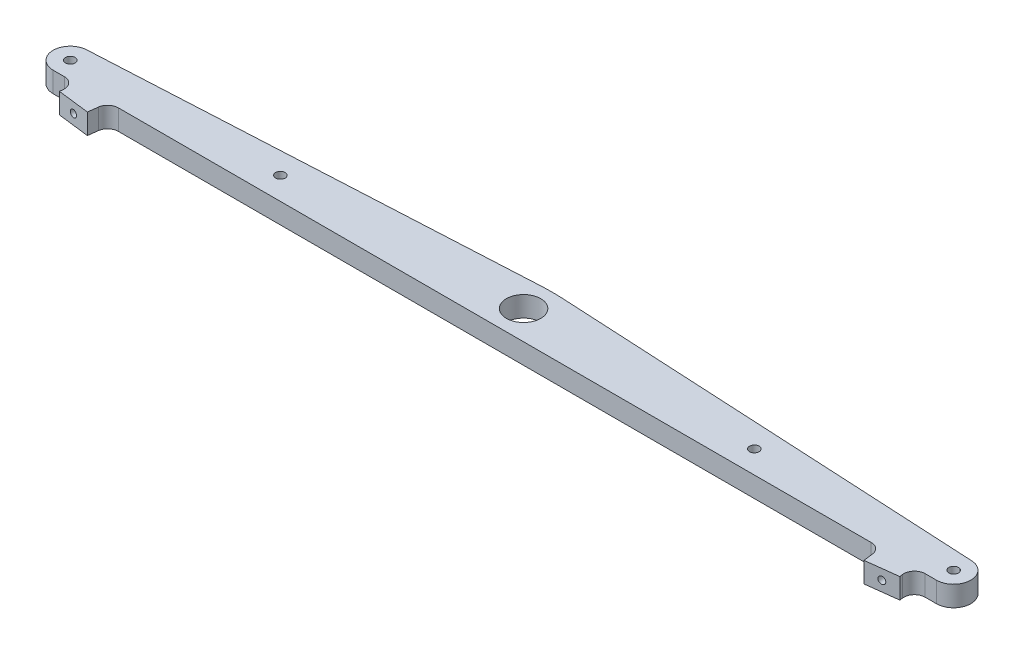
ISO-10303-21;
HEADER;
FILE_DESCRIPTION(('STEP AP214'),'2;1');
FILE_NAME('part.step','',(''),(''),'','','');
FILE_SCHEMA(('AUTOMOTIVE_DESIGN { 1 0 10303 214 1 1 1 1 }'));
ENDSEC;
DATA;
#1=APPLICATION_CONTEXT('core data for automotive mechanical design processes');
#2=APPLICATION_PROTOCOL_DEFINITION('international standard','automotive_design',2000,#1);
#3=PRODUCT_CONTEXT('',#1,'mechanical');
#4=PRODUCT('Part','Part','',(#3));
#5=PRODUCT_RELATED_PRODUCT_CATEGORY('part','',(#4));
#6=PRODUCT_DEFINITION_FORMATION('','',#4);
#7=PRODUCT_DEFINITION_CONTEXT('part definition',#1,'design');
#8=PRODUCT_DEFINITION('design','',#6,#7);
#9=PRODUCT_DEFINITION_SHAPE('','',#8);
#10=(LENGTH_UNIT() NAMED_UNIT(*) SI_UNIT(.MILLI.,.METRE.));
#11=(NAMED_UNIT(*) PLANE_ANGLE_UNIT() SI_UNIT($,.RADIAN.));
#12=(NAMED_UNIT(*) SI_UNIT($,.STERADIAN.) SOLID_ANGLE_UNIT());
#13=UNCERTAINTY_MEASURE_WITH_UNIT(LENGTH_MEASURE(1.E-05),#10,'distance_accuracy_value','');
#14=(GEOMETRIC_REPRESENTATION_CONTEXT(3) GLOBAL_UNCERTAINTY_ASSIGNED_CONTEXT((#13)) GLOBAL_UNIT_ASSIGNED_CONTEXT((#10,
#11,#12)) REPRESENTATION_CONTEXT('',''));
#15=CARTESIAN_POINT('',(0.,0.,0.));
#16=DIRECTION('',(0.,0.,1.));
#17=DIRECTION('',(1.,0.,0.));
#18=AXIS2_PLACEMENT_3D('',#15,#16,#17);
#19=CARTESIAN_POINT('',(-226.,9.525,13.4323716539672));
#20=DIRECTION('',(0.,0.,-1.));
#21=DIRECTION('',(-1.,0.,0.));
#22=AXIS2_PLACEMENT_3D('',#19,#20,#21);
#23=PLANE('',#22);
#24=DIRECTION('',(1.,0.,0.));
#25=VECTOR('',#24,1.);
#26=CARTESIAN_POINT('',(-226.,9.525,13.4323716539672));
#27=LINE('',#26,#25);
#28=CARTESIAN_POINT('',(200.764119313692,9.52500000000001,13.4323716539672));
#29=VERTEX_POINT('',#28);
#30=CARTESIAN_POINT('',(206.,9.52500000000001,13.4323716539672));
#31=VERTEX_POINT('',#30);
#32=EDGE_CURVE('E292',#29,#31,#27,.T.);
#33=ORIENTED_EDGE('',*,*,#32,.F.);
#34=DIRECTION('',(0.,1.,0.));
#35=VECTOR('',#34,1.);
#36=CARTESIAN_POINT('',(200.764119313692,0.,13.4323716539672));
#37=LINE('',#36,#35);
#38=CARTESIAN_POINT('',(200.764119313692,0.,13.4323716539672));
#39=VERTEX_POINT('',#38);
#40=EDGE_CURVE('E332',#29,#39,#37,.F.);
#41=ORIENTED_EDGE('',*,*,#40,.T.);
#42=DIRECTION('',(1.,0.,0.));
#43=VECTOR('',#42,1.);
#44=CARTESIAN_POINT('',(-226.,0.,13.4323716539673));
#45=LINE('',#44,#43);
#46=CARTESIAN_POINT('',(206.,0.,13.4323716539673));
#47=VERTEX_POINT('',#46);
#48=EDGE_CURVE('E304',#39,#47,#45,.T.);
#49=ORIENTED_EDGE('',*,*,#48,.T.);
#50=DIRECTION('',(0.,-1.,0.));
#51=VECTOR('',#50,1.);
#52=CARTESIAN_POINT('',(206.,9.52500000000001,13.4323716539672));
#53=LINE('',#52,#51);
#54=EDGE_CURVE('E238',#31,#47,#53,.T.);
#55=ORIENTED_EDGE('',*,*,#54,.F.);
#56=EDGE_LOOP('',(#33,#41,#49,#55));
#57=FACE_BOUND('',#56,.T.);
#58=ADVANCED_FACE('F46',(#57),#23,.F.);
#59=CARTESIAN_POINT('',(-175.576373677221,0.,13.4323716539673));
#60=VERTEX_POINT('',#59);
#61=CARTESIAN_POINT('',(175.576373677221,0.,13.4323716539672));
#62=VERTEX_POINT('',#61);
#63=EDGE_CURVE('E307',#60,#62,#45,.T.);
#64=ORIENTED_EDGE('',*,*,#63,.T.);
#65=DIRECTION('',(0.,1.,0.));
#66=VECTOR('',#65,1.);
#67=CARTESIAN_POINT('',(175.576373677221,9.525,13.4323716539672));
#68=LINE('',#67,#66);
#69=CARTESIAN_POINT('',(175.576373677221,9.525,13.4323716539672));
#70=VERTEX_POINT('',#69);
#71=EDGE_CURVE('E334',#62,#70,#68,.T.);
#72=ORIENTED_EDGE('',*,*,#71,.T.);
#73=CARTESIAN_POINT('',(-175.576373677221,9.52500000000001,13.4323716539673));
#74=VERTEX_POINT('',#73);
#75=EDGE_CURVE('E297',#74,#70,#27,.T.);
#76=ORIENTED_EDGE('',*,*,#75,.F.);
#77=DIRECTION('',(0.,1.,0.));
#78=VECTOR('',#77,1.);
#79=CARTESIAN_POINT('',(-175.576373677221,9.52500000000001,13.4323716539673));
#80=LINE('',#79,#78);
#81=EDGE_CURVE('E321',#74,#60,#80,.F.);
#82=ORIENTED_EDGE('',*,*,#81,.T.);
#83=EDGE_LOOP('',(#64,#72,#76,#82));
#84=FACE_BOUND('',#83,.T.);
#85=ADVANCED_FACE('F358',(#84),#23,.F.);
#86=CARTESIAN_POINT('',(-206.,0.,13.4323716539673));
#87=VERTEX_POINT('',#86);
#88=CARTESIAN_POINT('',(-200.764119313692,0.,13.4323716539672));
#89=VERTEX_POINT('',#88);
#90=EDGE_CURVE('E287',#87,#89,#45,.T.);
#91=ORIENTED_EDGE('',*,*,#90,.T.);
#92=DIRECTION('',(0.,1.,0.));
#93=VECTOR('',#92,1.);
#94=CARTESIAN_POINT('',(-200.764119313692,9.525,13.4323716539672));
#95=LINE('',#94,#93);
#96=CARTESIAN_POINT('',(-200.764119313692,9.525,13.4323716539672));
#97=VERTEX_POINT('',#96);
#98=EDGE_CURVE('E313',#89,#97,#95,.T.);
#99=ORIENTED_EDGE('',*,*,#98,.T.);
#100=CARTESIAN_POINT('',(-206.,9.525,13.4323716539672));
#101=VERTEX_POINT('',#100);
#102=EDGE_CURVE('E293',#101,#97,#27,.T.);
#103=ORIENTED_EDGE('',*,*,#102,.F.);
#104=DIRECTION('',(0.,-1.,0.));
#105=VECTOR('',#104,1.);
#106=CARTESIAN_POINT('',(-206.,9.525,13.4323716539672));
#107=LINE('',#106,#105);
#108=EDGE_CURVE('E258',#101,#87,#107,.T.);
#109=ORIENTED_EDGE('',*,*,#108,.T.);
#110=EDGE_LOOP('',(#91,#99,#103,#109));
#111=FACE_BOUND('',#110,.T.);
#112=ADVANCED_FACE('F386',(#111),#23,.F.);
#113=CARTESIAN_POINT('',(226.392788823538,9.525,-1.56762834603279));
#114=DIRECTION('',(-0.0523359562429366,0.,0.998629534754575));
#115=DIRECTION('',(0.998629534754576,0.,0.0523359562429366));
#116=AXIS2_PLACEMENT_3D('',#113,#114,#115);
#117=PLANE('',#116);
#118=CARTESIAN_POINT('',(185.451100995567,4.76250000000002,-3.71329128519596));
#119=DIRECTION('',(-0.0523359562429366,0.,0.998629534754575));
#120=DIRECTION('',(0.998629534754576,0.,0.0523359562429366));
#121=AXIS2_PLACEMENT_3D('',#118,#119,#120);
#122=ELLIPSE('',#121,1.67545390961147,1.64999999999999);
#123=CARTESIAN_POINT('',(187.124258753825,4.76250000000002,-3.62560480269548));
#124=VERTEX_POINT('',#123);
#125=EDGE_CURVE('E194',#124,#124,#122,.T.);
#126=ORIENTED_EDGE('',*,*,#125,.T.);
#127=EDGE_LOOP('',(#126));
#128=FACE_BOUND('',#127,.T.);
#129=DIRECTION('',(0.,-1.,0.));
#130=VECTOR('',#129,1.);
#131=CARTESIAN_POINT('',(206.420198128447,9.525,-2.61434747089145));
#132=LINE('',#131,#130);
#133=CARTESIAN_POINT('',(206.420198128447,9.525,-2.61434747089145));
#134=VERTEX_POINT('',#133);
#135=CARTESIAN_POINT('',(206.420198128447,0.,-2.61434747089146));
#136=VERTEX_POINT('',#135);
#137=EDGE_CURVE('E236',#134,#136,#132,.T.);
#138=ORIENTED_EDGE('',*,*,#137,.T.);
#139=DIRECTION('',(-0.998629534754575,0.,-0.0523359562429366));
#140=VECTOR('',#139,1.);
#141=CARTESIAN_POINT('',(226.392788823538,0.,-1.56762834603279));
#142=LINE('',#141,#140);
#143=CARTESIAN_POINT('',(5.23359562429371,0.,-13.1580905296327));
#144=VERTEX_POINT('',#143);
#145=EDGE_CURVE('E281',#136,#144,#142,.T.);
#146=ORIENTED_EDGE('',*,*,#145,.T.);
#147=DIRECTION('',(0.,-1.,0.));
#148=VECTOR('',#147,1.);
#149=CARTESIAN_POINT('',(5.23359562429371,9.525,-13.1580905296326));
#150=LINE('',#149,#148);
#151=CARTESIAN_POINT('',(5.23359562429371,9.525,-13.1580905296326));
#152=VERTEX_POINT('',#151);
#153=EDGE_CURVE('E310',#152,#144,#150,.T.);
#154=ORIENTED_EDGE('',*,*,#153,.F.);
#155=DIRECTION('',(-0.998629534754575,0.,-0.0523359562429366));
#156=VECTOR('',#155,1.);
#157=CARTESIAN_POINT('',(226.392788823538,9.525,-1.56762834603279));
#158=LINE('',#157,#156);
#159=EDGE_CURVE('E284',#134,#152,#158,.T.);
#160=ORIENTED_EDGE('',*,*,#159,.F.);
#161=EDGE_LOOP('',(#138,#146,#154,#160));
#162=FACE_BOUND('',#161,.T.);
#163=ADVANCED_FACE('F404',(#128,#162),#117,.F.);
#164=CARTESIAN_POINT('',(-5.23359562429371,9.525,-13.1580905296326));
#165=DIRECTION('',(0.0523359562429369,0.,0.998629534754576));
#166=DIRECTION('',(0.998629534754576,0.,-0.0523359562429369));
#167=AXIS2_PLACEMENT_3D('',#164,#165,#166);
#168=PLANE('',#167);
#169=CARTESIAN_POINT('',(-185.451100995567,4.76250000000001,-3.71329128519591));
#170=DIRECTION('',(0.0523359562429369,0.,0.998629534754576));
#171=DIRECTION('',(-0.998629534754576,0.,0.0523359562429369));
#172=AXIS2_PLACEMENT_3D('',#169,#170,#171);
#173=ELLIPSE('',#172,1.67545390961147,1.64999999999999);
#174=CARTESIAN_POINT('',(-187.124258753825,4.76250000000001,-3.62560480269543));
#175=VERTEX_POINT('',#174);
#176=EDGE_CURVE('E210',#175,#175,#173,.T.);
#177=ORIENTED_EDGE('',*,*,#176,.T.);
#178=EDGE_LOOP('',(#177));
#179=FACE_BOUND('',#178,.T.);
#180=DIRECTION('',(0.,-1.,0.));
#181=VECTOR('',#180,1.);
#182=CARTESIAN_POINT('',(-206.420198128446,9.525,-2.61434747089147));
#183=LINE('',#182,#181);
#184=CARTESIAN_POINT('',(-206.420198128446,9.525,-2.61434747089147));
#185=VERTEX_POINT('',#184);
#186=CARTESIAN_POINT('',(-206.420198128446,0.,-2.61434747089147));
#187=VERTEX_POINT('',#186);
#188=EDGE_CURVE('E261',#185,#187,#183,.T.);
#189=ORIENTED_EDGE('',*,*,#188,.F.);
#190=DIRECTION('',(-0.998629534754576,0.,0.0523359562429369));
#191=VECTOR('',#190,1.);
#192=CARTESIAN_POINT('',(-5.23359562429371,9.525,-13.1580905296326));
#193=LINE('',#192,#191);
#194=CARTESIAN_POINT('',(-5.23359562429371,9.525,-13.1580905296326));
#195=VERTEX_POINT('',#194);
#196=EDGE_CURVE('E289',#195,#185,#193,.T.);
#197=ORIENTED_EDGE('',*,*,#196,.F.);
#198=DIRECTION('',(0.,-1.,0.));
#199=VECTOR('',#198,1.);
#200=CARTESIAN_POINT('',(-5.23359562429371,9.525,-13.1580905296326));
#201=LINE('',#200,#199);
#202=CARTESIAN_POINT('',(-5.23359562429371,0.,-13.1580905296326));
#203=VERTEX_POINT('',#202);
#204=EDGE_CURVE('E296',#195,#203,#201,.T.);
#205=ORIENTED_EDGE('',*,*,#204,.T.);
#206=DIRECTION('',(-0.998629534754576,0.,0.0523359562429369));
#207=VECTOR('',#206,1.);
#208=CARTESIAN_POINT('',(-5.23359562429371,0.,-13.1580905296326));
#209=LINE('',#208,#207);
#210=EDGE_CURVE('E301',#203,#187,#209,.T.);
#211=ORIENTED_EDGE('',*,*,#210,.T.);
#212=EDGE_LOOP('',(#189,#197,#205,#211));
#213=FACE_BOUND('',#212,.T.);
#214=ADVANCED_FACE('F396',(#179,#213),#168,.F.);
#215=CARTESIAN_POINT('',(226.,9.525,5.927228885304));
#216=DIRECTION('',(0.,1.,0.));
#217=DIRECTION('',(0.,0.,1.));
#218=AXIS2_PLACEMENT_3D('',#215,#216,#217);
#219=PLANE('',#218);
#220=CARTESIAN_POINT('',(206.,9.525,5.40351045392039));
#221=DIRECTION('',(0.,1.,0.));
#222=DIRECTION('',(0.,0.,-1.));
#223=AXIS2_PLACEMENT_3D('',#220,#221,#222);
#224=CIRCLE('',#223,8.02886120004685);
#225=EDGE_CURVE('E234',#31,#134,#224,.T.);
#226=ORIENTED_EDGE('',*,*,#225,.T.);
#227=ORIENTED_EDGE('',*,*,#159,.T.);
#228=CARTESIAN_POINT('',(0.,9.525,86.704862945825));
#229=DIRECTION('',(0.,1.,0.));
#230=DIRECTION('',(0.,0.,1.));
#231=AXIS2_PLACEMENT_3D('',#228,#229,#230);
#232=CIRCLE('',#231,100.);
#233=EDGE_CURVE('E286',#152,#195,#232,.T.);
#234=ORIENTED_EDGE('',*,*,#233,.T.);
#235=ORIENTED_EDGE('',*,*,#196,.T.);
#236=CARTESIAN_POINT('',(-206.,9.525,5.40351045392039));
#237=DIRECTION('',(0.,-1.,0.));
#238=DIRECTION('',(0.,0.,-1.));
#239=AXIS2_PLACEMENT_3D('',#236,#237,#238);
#240=CIRCLE('',#239,8.02886120004685);
#241=EDGE_CURVE('E256',#101,#185,#240,.T.);
#242=ORIENTED_EDGE('',*,*,#241,.F.);
#243=ORIENTED_EDGE('',*,*,#102,.T.);
#244=CARTESIAN_POINT('',(-200.764119313692,9.525,18.4323716539672));
#245=DIRECTION('',(0.,1.,0.));
#246=DIRECTION('',(0.,0.,1.));
#247=AXIS2_PLACEMENT_3D('',#244,#245,#246);
#248=CIRCLE('',#247,5.);
#249=CARTESIAN_POINT('',(-195.801388555485,9.525,19.041718370993));
#250=VERTEX_POINT('',#249);
#251=EDGE_CURVE('E323',#97,#250,#248,.F.);
#252=ORIENTED_EDGE('',*,*,#251,.T.);
#253=DIRECTION('',(-0.121869343405149,0.,0.992546151641324));
#254=VECTOR('',#253,1.);
#255=CARTESIAN_POINT('',(-190.590015232996,9.525,-23.4015113328616));
#256=LINE('',#255,#254);
#257=CARTESIAN_POINT('',(-195.982696315475,9.52500000000001,20.5183515784287));
#258=VERTEX_POINT('',#257);
#259=EDGE_CURVE('E226',#250,#258,#256,.T.);
#260=ORIENTED_EDGE('',*,*,#259,.T.);
#261=DIRECTION('',(0.992546151641324,0.,0.121869343405149));
#262=VECTOR('',#261,1.);
#263=CARTESIAN_POINT('',(-5.39268108247831,9.52500000000001,43.9198629112901));
#264=LINE('',#263,#262);
#265=CARTESIAN_POINT('',(-181.094504040855,9.52500000000001,22.3463917295059));
#266=VERTEX_POINT('',#265);
#267=EDGE_CURVE('E213',#258,#266,#264,.T.);
#268=ORIENTED_EDGE('',*,*,#267,.T.);
#269=DIRECTION('',(0.121869343405144,0.,-0.992546151641325));
#270=VECTOR('',#269,1.);
#271=CARTESIAN_POINT('',(-175.701822958377,9.525,-21.5734711817834));
#272=LINE('',#271,#270);
#273=CARTESIAN_POINT('',(-180.539104435427,9.525,17.8230249369416));
#274=VERTEX_POINT('',#273);
#275=EDGE_CURVE('E223',#266,#274,#272,.T.);
#276=ORIENTED_EDGE('',*,*,#275,.T.);
#277=CARTESIAN_POINT('',(-175.576373677221,9.525,18.4323716539673));
#278=DIRECTION('',(0.,1.,0.));
#279=DIRECTION('',(0.,0.,1.));
#280=AXIS2_PLACEMENT_3D('',#277,#278,#279);
#281=CIRCLE('',#280,5.);
#282=EDGE_CURVE('E327',#274,#74,#281,.F.);
#283=ORIENTED_EDGE('',*,*,#282,.T.);
#284=ORIENTED_EDGE('',*,*,#75,.T.);
#285=CARTESIAN_POINT('',(175.576373677221,9.525,18.4323716539672));
#286=DIRECTION('',(0.,1.,0.));
#287=DIRECTION('',(0.,0.,1.));
#288=AXIS2_PLACEMENT_3D('',#285,#286,#287);
#289=CIRCLE('',#288,5.);
#290=CARTESIAN_POINT('',(180.539104435427,9.525,17.8230249369415));
#291=VERTEX_POINT('',#290);
#292=EDGE_CURVE('E54',#70,#291,#289,.F.);
#293=ORIENTED_EDGE('',*,*,#292,.T.);
#294=DIRECTION('',(-0.121869343405144,0.,-0.992546151641324));
#295=VECTOR('',#294,1.);
#296=CARTESIAN_POINT('',(175.701822958377,9.525,-21.5734711817834));
#297=LINE('',#296,#295);
#298=CARTESIAN_POINT('',(181.094504040855,9.525,22.3463917295059));
#299=VERTEX_POINT('',#298);
#300=EDGE_CURVE('E179',#299,#291,#297,.T.);
#301=ORIENTED_EDGE('',*,*,#300,.F.);
#302=DIRECTION('',(-0.992546151641324,0.,0.121869343405149));
#303=VECTOR('',#302,1.);
#304=CARTESIAN_POINT('',(5.39268108247853,9.525,43.9198629112902));
#305=LINE('',#304,#303);
#306=CARTESIAN_POINT('',(195.982696315475,9.525,20.5183515784287));
#307=VERTEX_POINT('',#306);
#308=EDGE_CURVE('E180',#307,#299,#305,.T.);
#309=ORIENTED_EDGE('',*,*,#308,.F.);
#310=DIRECTION('',(0.121869343405149,0.,0.992546151641324));
#311=VECTOR('',#310,1.);
#312=CARTESIAN_POINT('',(190.590015232996,9.525,-23.4015113328616));
#313=LINE('',#312,#311);
#314=CARTESIAN_POINT('',(195.801388555485,9.525,19.041718370993));
#315=VERTEX_POINT('',#314);
#316=EDGE_CURVE('E171',#315,#307,#313,.T.);
#317=ORIENTED_EDGE('',*,*,#316,.F.);
#318=CARTESIAN_POINT('',(200.764119313692,9.525,18.4323716539672));
#319=DIRECTION('',(0.,1.,0.));
#320=DIRECTION('',(0.,0.,1.));
#321=AXIS2_PLACEMENT_3D('',#318,#319,#320);
#322=CIRCLE('',#321,5.);
#323=EDGE_CURVE('E338',#315,#29,#322,.F.);
#324=ORIENTED_EDGE('',*,*,#323,.T.);
#325=ORIENTED_EDGE('',*,*,#32,.T.);
#326=EDGE_LOOP('',(#226,#227,#234,#235,#242,#243,#252,#260,#268,#276,#283,#284,#293,#301,#309,
#317,#324,#325));
#327=FACE_BOUND('',#326,.T.);
#328=CARTESIAN_POINT('',(206.,9.525,5.40297223036731));
#329=DIRECTION('',(0.,1.,0.));
#330=DIRECTION('',(0.,0.,-1.));
#331=AXIS2_PLACEMENT_3D('',#328,#329,#330);
#332=CIRCLE('',#331,2.25000000000001);
#333=CARTESIAN_POINT('',(206.,9.525,3.1529722303673));
#334=VERTEX_POINT('',#333);
#335=EDGE_CURVE('E244',#334,#334,#332,.T.);
#336=ORIENTED_EDGE('',*,*,#335,.F.);
#337=EDGE_LOOP('',(#336));
#338=FACE_BOUND('',#337,.T.);
#339=CARTESIAN_POINT('',(110.515692217512,9.52500000000001,2.90005804051734));
#340=DIRECTION('',(0.,1.,0.));
#341=DIRECTION('',(0.,0.,-1.));
#342=AXIS2_PLACEMENT_3D('',#339,#340,#341);
#343=CIRCLE('',#342,2.25);
#344=CARTESIAN_POINT('',(110.515692217512,9.52500000000001,0.650058040517337));
#345=VERTEX_POINT('',#344);
#346=EDGE_CURVE('E251',#345,#345,#343,.T.);
#347=ORIENTED_EDGE('',*,*,#346,.F.);
#348=EDGE_LOOP('',(#347));
#349=FACE_BOUND('',#348,.T.);
#350=CARTESIAN_POINT('',(-206.,9.525,5.40297223036729));
#351=DIRECTION('',(0.,-1.,0.));
#352=DIRECTION('',(0.,0.,-1.));
#353=AXIS2_PLACEMENT_3D('',#350,#351,#352);
#354=CIRCLE('',#353,2.25000000000001);
#355=CARTESIAN_POINT('',(-206.,9.525,3.15297223036728));
#356=VERTEX_POINT('',#355);
#357=EDGE_CURVE('E266',#356,#356,#354,.T.);
#358=ORIENTED_EDGE('',*,*,#357,.T.);
#359=EDGE_LOOP('',(#358));
#360=FACE_BOUND('',#359,.T.);
#361=CARTESIAN_POINT('',(-110.515692217512,9.525,2.90005804051729));
#362=DIRECTION('',(0.,-1.,0.));
#363=DIRECTION('',(0.,0.,-1.));
#364=AXIS2_PLACEMENT_3D('',#361,#362,#363);
#365=CIRCLE('',#364,2.25);
#366=CARTESIAN_POINT('',(-110.515692217512,9.525,0.650058040517295));
#367=VERTEX_POINT('',#366);
#368=EDGE_CURVE('E263',#367,#367,#365,.T.);
#369=ORIENTED_EDGE('',*,*,#368,.T.);
#370=EDGE_LOOP('',(#369));
#371=FACE_BOUND('',#370,.T.);
#372=CARTESIAN_POINT('',(0.,9.525,0.));
#373=DIRECTION('',(0.,-1.,0.));
#374=DIRECTION('',(0.,0.,-1.));
#375=AXIS2_PLACEMENT_3D('',#372,#373,#374);
#376=CIRCLE('',#375,8.);
#377=CARTESIAN_POINT('',(0.,9.525,-8.00000000000001));
#378=VERTEX_POINT('',#377);
#379=EDGE_CURVE('E278',#378,#378,#376,.T.);
#380=ORIENTED_EDGE('',*,*,#379,.T.);
#381=EDGE_LOOP('',(#380));
#382=FACE_BOUND('',#381,.T.);
#383=ADVANCED_FACE('F192',(#327,#338,#349,#360,#371,#382),#219,.T.);
#384=CARTESIAN_POINT('',(226.,0.,5.927228885304));
#385=DIRECTION('',(0.,1.,0.));
#386=DIRECTION('',(0.,0.,1.));
#387=AXIS2_PLACEMENT_3D('',#384,#385,#386);
#388=PLANE('',#387);
#389=CARTESIAN_POINT('',(206.,0.,5.4029722303673));
#390=DIRECTION('',(0.,1.,0.));
#391=DIRECTION('',(0.,0.,-1.));
#392=AXIS2_PLACEMENT_3D('',#389,#390,#391);
#393=CIRCLE('',#392,2.25000000000001);
#394=CARTESIAN_POINT('',(206.,0.,3.15297223036729));
#395=VERTEX_POINT('',#394);
#396=EDGE_CURVE('E248',#395,#395,#393,.T.);
#397=ORIENTED_EDGE('',*,*,#396,.T.);
#398=EDGE_LOOP('',(#397));
#399=FACE_BOUND('',#398,.T.);
#400=CARTESIAN_POINT('',(110.515692217512,0.,2.90005804051731));
#401=DIRECTION('',(0.,1.,0.));
#402=DIRECTION('',(0.,0.,-1.));
#403=AXIS2_PLACEMENT_3D('',#400,#401,#402);
#404=CIRCLE('',#403,2.25);
#405=CARTESIAN_POINT('',(110.515692217512,0.,0.650058040517309));
#406=VERTEX_POINT('',#405);
#407=EDGE_CURVE('E241',#406,#406,#404,.T.);
#408=ORIENTED_EDGE('',*,*,#407,.T.);
#409=EDGE_LOOP('',(#408));
#410=FACE_BOUND('',#409,.T.);
#411=CARTESIAN_POINT('',(0.,0.,0.));
#412=DIRECTION('',(0.,-1.,0.));
#413=DIRECTION('',(0.,0.,-1.));
#414=AXIS2_PLACEMENT_3D('',#411,#412,#413);
#415=CIRCLE('',#414,8.);
#416=CARTESIAN_POINT('',(0.,0.,-8.00000000000001));
#417=VERTEX_POINT('',#416);
#418=EDGE_CURVE('E269',#417,#417,#415,.T.);
#419=ORIENTED_EDGE('',*,*,#418,.F.);
#420=EDGE_LOOP('',(#419));
#421=FACE_BOUND('',#420,.T.);
#422=CARTESIAN_POINT('',(-110.515692217512,0.,2.90005804051731));
#423=DIRECTION('',(0.,-1.,0.));
#424=DIRECTION('',(0.,0.,-1.));
#425=AXIS2_PLACEMENT_3D('',#422,#423,#424);
#426=CIRCLE('',#425,2.25);
#427=CARTESIAN_POINT('',(-110.515692217512,0.,0.650058040517309));
#428=VERTEX_POINT('',#427);
#429=EDGE_CURVE('E273',#428,#428,#426,.T.);
#430=ORIENTED_EDGE('',*,*,#429,.F.);
#431=EDGE_LOOP('',(#430));
#432=FACE_BOUND('',#431,.T.);
#433=CARTESIAN_POINT('',(-206.,0.,5.40297223036729));
#434=DIRECTION('',(0.,-1.,0.));
#435=DIRECTION('',(0.,0.,-1.));
#436=AXIS2_PLACEMENT_3D('',#433,#434,#435);
#437=CIRCLE('',#436,2.25000000000001);
#438=CARTESIAN_POINT('',(-206.,0.,3.15297223036727));
#439=VERTEX_POINT('',#438);
#440=EDGE_CURVE('E270',#439,#439,#437,.T.);
#441=ORIENTED_EDGE('',*,*,#440,.F.);
#442=EDGE_LOOP('',(#441));
#443=FACE_BOUND('',#442,.T.);
#444=ORIENTED_EDGE('',*,*,#145,.F.);
#445=CARTESIAN_POINT('',(206.,0.,5.4035104539204));
#446=DIRECTION('',(0.,1.,0.));
#447=DIRECTION('',(0.,0.,-1.));
#448=AXIS2_PLACEMENT_3D('',#445,#446,#447);
#449=CIRCLE('',#448,8.02886120004685);
#450=EDGE_CURVE('E233',#47,#136,#449,.T.);
#451=ORIENTED_EDGE('',*,*,#450,.F.);
#452=ORIENTED_EDGE('',*,*,#48,.F.);
#453=CARTESIAN_POINT('',(200.764119313692,0.,18.4323716539672));
#454=DIRECTION('',(0.,1.,0.));
#455=DIRECTION('',(0.,0.,1.));
#456=AXIS2_PLACEMENT_3D('',#453,#454,#455);
#457=CIRCLE('',#456,5.);
#458=CARTESIAN_POINT('',(195.801388555485,0.,19.041718370993));
#459=VERTEX_POINT('',#458);
#460=EDGE_CURVE('E340',#39,#459,#457,.T.);
#461=ORIENTED_EDGE('',*,*,#460,.T.);
#462=DIRECTION('',(-0.121869343405149,0.,-0.992546151641324));
#463=VECTOR('',#462,1.);
#464=CARTESIAN_POINT('',(190.590015232996,0.,-23.4015113328616));
#465=LINE('',#464,#463);
#466=CARTESIAN_POINT('',(195.982696315475,0.,20.5183515784287));
#467=VERTEX_POINT('',#466);
#468=EDGE_CURVE('E203',#467,#459,#465,.T.);
#469=ORIENTED_EDGE('',*,*,#468,.F.);
#470=DIRECTION('',(0.992546151641324,0.,-0.121869343405149));
#471=VECTOR('',#470,1.);
#472=CARTESIAN_POINT('',(5.39268108247853,0.,43.9198629112901));
#473=LINE('',#472,#471);
#474=CARTESIAN_POINT('',(181.094504040855,0.,22.3463917295059));
#475=VERTEX_POINT('',#474);
#476=EDGE_CURVE('E188',#475,#467,#473,.T.);
#477=ORIENTED_EDGE('',*,*,#476,.F.);
#478=DIRECTION('',(0.121869343405144,0.,0.992546151641324));
#479=VECTOR('',#478,1.);
#480=CARTESIAN_POINT('',(175.701822958377,0.,-21.5734711817834));
#481=LINE('',#480,#479);
#482=CARTESIAN_POINT('',(180.539104435427,0.,17.8230249369415));
#483=VERTEX_POINT('',#482);
#484=EDGE_CURVE('E206',#483,#475,#481,.T.);
#485=ORIENTED_EDGE('',*,*,#484,.F.);
#486=CARTESIAN_POINT('',(175.576373677221,0.,18.4323716539672));
#487=DIRECTION('',(0.,1.,0.));
#488=DIRECTION('',(0.,0.,1.));
#489=AXIS2_PLACEMENT_3D('',#486,#487,#488);
#490=CIRCLE('',#489,5.);
#491=EDGE_CURVE('E11',#483,#62,#490,.T.);
#492=ORIENTED_EDGE('',*,*,#491,.T.);
#493=ORIENTED_EDGE('',*,*,#63,.F.);
#494=CARTESIAN_POINT('',(-175.576373677221,0.,18.4323716539673));
#495=DIRECTION('',(0.,1.,0.));
#496=DIRECTION('',(0.,0.,1.));
#497=AXIS2_PLACEMENT_3D('',#494,#495,#496);
#498=CIRCLE('',#497,5.);
#499=CARTESIAN_POINT('',(-180.539104435427,0.,17.8230249369415));
#500=VERTEX_POINT('',#499);
#501=EDGE_CURVE('E329',#60,#500,#498,.T.);
#502=ORIENTED_EDGE('',*,*,#501,.T.);
#503=DIRECTION('',(-0.121869343405144,0.,0.992546151641325));
#504=VECTOR('',#503,1.);
#505=CARTESIAN_POINT('',(-175.701822958377,0.,-21.5734711817834));
#506=LINE('',#505,#504);
#507=CARTESIAN_POINT('',(-181.094504040855,0.,22.3463917295059));
#508=VERTEX_POINT('',#507);
#509=EDGE_CURVE('E220',#500,#508,#506,.T.);
#510=ORIENTED_EDGE('',*,*,#509,.T.);
#511=DIRECTION('',(-0.992546151641324,0.,-0.121869343405149));
#512=VECTOR('',#511,1.);
#513=CARTESIAN_POINT('',(-5.39268108247831,0.,43.9198629112902));
#514=LINE('',#513,#512);
#515=CARTESIAN_POINT('',(-195.982696315475,0.,20.5183515784286));
#516=VERTEX_POINT('',#515);
#517=EDGE_CURVE('E217',#508,#516,#514,.T.);
#518=ORIENTED_EDGE('',*,*,#517,.T.);
#519=DIRECTION('',(0.121869343405149,0.,-0.992546151641324));
#520=VECTOR('',#519,1.);
#521=CARTESIAN_POINT('',(-190.590015232996,0.,-23.4015113328616));
#522=LINE('',#521,#520);
#523=CARTESIAN_POINT('',(-195.801388555485,0.,19.041718370993));
#524=VERTEX_POINT('',#523);
#525=EDGE_CURVE('E214',#516,#524,#522,.T.);
#526=ORIENTED_EDGE('',*,*,#525,.T.);
#527=CARTESIAN_POINT('',(-200.764119313692,0.,18.4323716539672));
#528=DIRECTION('',(0.,1.,0.));
#529=DIRECTION('',(0.,0.,1.));
#530=AXIS2_PLACEMENT_3D('',#527,#528,#529);
#531=CIRCLE('',#530,5.);
#532=EDGE_CURVE('E325',#524,#89,#531,.T.);
#533=ORIENTED_EDGE('',*,*,#532,.T.);
#534=ORIENTED_EDGE('',*,*,#90,.F.);
#535=CARTESIAN_POINT('',(-206.,0.,5.40351045392039));
#536=DIRECTION('',(0.,-1.,0.));
#537=DIRECTION('',(0.,0.,-1.));
#538=AXIS2_PLACEMENT_3D('',#535,#536,#537);
#539=CIRCLE('',#538,8.02886120004685);
#540=EDGE_CURVE('E247',#87,#187,#539,.T.);
#541=ORIENTED_EDGE('',*,*,#540,.T.);
#542=ORIENTED_EDGE('',*,*,#210,.F.);
#543=CARTESIAN_POINT('',(0.,0.,86.704862945825));
#544=DIRECTION('',(0.,1.,0.));
#545=DIRECTION('',(0.,0.,1.));
#546=AXIS2_PLACEMENT_3D('',#543,#544,#545);
#547=CIRCLE('',#546,100.);
#548=EDGE_CURVE('E299',#144,#203,#547,.T.);
#549=ORIENTED_EDGE('',*,*,#548,.F.);
#550=EDGE_LOOP('',(#444,#451,#452,#461,#469,#477,#485,#492,#493,#502,#510,#518,#526,#533,#534,
#541,#542,#549));
#551=FACE_BOUND('',#550,.T.);
#552=ADVANCED_FACE('F345',(#399,#410,#421,#432,#443,#551),#388,.F.);
#553=CARTESIAN_POINT('',(0.,9.525,86.704862945825));
#554=DIRECTION('',(0.,-1.,0.));
#555=DIRECTION('',(0.,0.,-1.));
#556=AXIS2_PLACEMENT_3D('',#553,#554,#555);
#557=CYLINDRICAL_SURFACE('',#556,100.);
#558=ORIENTED_EDGE('',*,*,#548,.T.);
#559=ORIENTED_EDGE('',*,*,#204,.F.);
#560=ORIENTED_EDGE('',*,*,#233,.F.);
#561=ORIENTED_EDGE('',*,*,#153,.T.);
#562=EDGE_LOOP('',(#558,#559,#560,#561));
#563=FACE_BOUND('',#562,.T.);
#564=ADVANCED_FACE('F400',(#563),#557,.T.);
#565=CARTESIAN_POINT('',(0.,9.525,0.));
#566=DIRECTION('',(0.,-1.,0.));
#567=DIRECTION('',(0.,0.,-1.));
#568=AXIS2_PLACEMENT_3D('',#565,#566,#567);
#569=CYLINDRICAL_SURFACE('',#568,8.);
#570=ORIENTED_EDGE('',*,*,#379,.F.);
#571=EDGE_LOOP('',(#570));
#572=FACE_BOUND('',#571,.T.);
#573=ORIENTED_EDGE('',*,*,#418,.T.);
#574=EDGE_LOOP('',(#573));
#575=FACE_BOUND('',#574,.T.);
#576=ADVANCED_FACE('F633',(#572,#575),#569,.F.);
#577=CARTESIAN_POINT('',(-110.515692217512,9.525,2.90005804051729));
#578=DIRECTION('',(0.,-1.,0.));
#579=DIRECTION('',(0.,0.,-1.));
#580=AXIS2_PLACEMENT_3D('',#577,#578,#579);
#581=CYLINDRICAL_SURFACE('',#580,2.25);
#582=ORIENTED_EDGE('',*,*,#368,.F.);
#583=EDGE_LOOP('',(#582));
#584=FACE_BOUND('',#583,.T.);
#585=ORIENTED_EDGE('',*,*,#429,.T.);
#586=EDGE_LOOP('',(#585));
#587=FACE_BOUND('',#586,.T.);
#588=ADVANCED_FACE('F623',(#584,#587),#581,.F.);
#589=CARTESIAN_POINT('',(-206.,9.525,5.40297223036729));
#590=DIRECTION('',(0.,-1.,0.));
#591=DIRECTION('',(0.,0.,-1.));
#592=AXIS2_PLACEMENT_3D('',#589,#590,#591);
#593=CYLINDRICAL_SURFACE('',#592,2.25000000000001);
#594=ORIENTED_EDGE('',*,*,#357,.F.);
#595=EDGE_LOOP('',(#594));
#596=FACE_BOUND('',#595,.T.);
#597=ORIENTED_EDGE('',*,*,#440,.T.);
#598=EDGE_LOOP('',(#597));
#599=FACE_BOUND('',#598,.T.);
#600=ADVANCED_FACE('F613',(#596,#599),#593,.F.);
#601=CARTESIAN_POINT('',(-206.,9.525,5.40351045392039));
#602=DIRECTION('',(0.,-1.,0.));
#603=DIRECTION('',(0.,0.,-1.));
#604=AXIS2_PLACEMENT_3D('',#601,#602,#603);
#605=CYLINDRICAL_SURFACE('',#604,8.02886120004685);
#606=ORIENTED_EDGE('',*,*,#540,.F.);
#607=ORIENTED_EDGE('',*,*,#108,.F.);
#608=ORIENTED_EDGE('',*,*,#241,.T.);
#609=ORIENTED_EDGE('',*,*,#188,.T.);
#610=EDGE_LOOP('',(#606,#607,#608,#609));
#611=FACE_BOUND('',#610,.T.);
#612=ADVANCED_FACE('F390',(#611),#605,.T.);
#613=CARTESIAN_POINT('',(110.515692217512,9.52500000000001,2.90005804051734));
#614=DIRECTION('',(0.,-1.,0.));
#615=DIRECTION('',(0.,0.,-1.));
#616=AXIS2_PLACEMENT_3D('',#613,#614,#615);
#617=CYLINDRICAL_SURFACE('',#616,2.25);
#618=ORIENTED_EDGE('',*,*,#346,.T.);
#619=EDGE_LOOP('',(#618));
#620=FACE_BOUND('',#619,.T.);
#621=ORIENTED_EDGE('',*,*,#407,.F.);
#622=EDGE_LOOP('',(#621));
#623=FACE_BOUND('',#622,.T.);
#624=ADVANCED_FACE('F416',(#620,#623),#617,.F.);
#625=CARTESIAN_POINT('',(206.,9.525,5.40297223036731));
#626=DIRECTION('',(0.,-1.,0.));
#627=DIRECTION('',(0.,0.,-1.));
#628=AXIS2_PLACEMENT_3D('',#625,#626,#627);
#629=CYLINDRICAL_SURFACE('',#628,2.25000000000001);
#630=ORIENTED_EDGE('',*,*,#335,.T.);
#631=EDGE_LOOP('',(#630));
#632=FACE_BOUND('',#631,.T.);
#633=ORIENTED_EDGE('',*,*,#396,.F.);
#634=EDGE_LOOP('',(#633));
#635=FACE_BOUND('',#634,.T.);
#636=ADVANCED_FACE('F408',(#632,#635),#629,.F.);
#637=CARTESIAN_POINT('',(206.,9.525,5.40351045392039));
#638=DIRECTION('',(0.,-1.,0.));
#639=DIRECTION('',(0.,0.,-1.));
#640=AXIS2_PLACEMENT_3D('',#637,#638,#639);
#641=CYLINDRICAL_SURFACE('',#640,8.02886120004685);
#642=ORIENTED_EDGE('',*,*,#450,.T.);
#643=ORIENTED_EDGE('',*,*,#137,.F.);
#644=ORIENTED_EDGE('',*,*,#225,.F.);
#645=ORIENTED_EDGE('',*,*,#54,.T.);
#646=EDGE_LOOP('',(#642,#643,#644,#645));
#647=FACE_BOUND('',#646,.T.);
#648=ADVANCED_FACE('F406',(#647),#641,.T.);
#649=CARTESIAN_POINT('',(-5.39268108247831,-18.3004463175024,43.9198629112901));
#650=DIRECTION('',(-0.121869343405149,0.,0.992546151641324));
#651=DIRECTION('',(0.992546151641324,0.,0.121869343405149));
#652=AXIS2_PLACEMENT_3D('',#649,#650,#651);
#653=PLANE('',#652);
#654=CARTESIAN_POINT('',(-188.538600178165,4.76250000000001,21.4323716539674));
#655=DIRECTION('',(-0.121869343405148,0.,0.992546151641324));
#656=DIRECTION('',(0.992546151641324,0.,0.121869343405148));
#657=AXIS2_PLACEMENT_3D('',#654,#655,#656);
#658=CIRCLE('',#657,1.64999999999999);
#659=CARTESIAN_POINT('',(-186.900899027956,4.76250000000001,21.6334560705859));
#660=VERTEX_POINT('',#659);
#661=EDGE_CURVE('E207',#660,#660,#658,.T.);
#662=ORIENTED_EDGE('',*,*,#661,.F.);
#663=EDGE_LOOP('',(#662));
#664=FACE_BOUND('',#663,.T.);
#665=ORIENTED_EDGE('',*,*,#517,.F.);
#666=DIRECTION('',(0.,1.,0.));
#667=VECTOR('',#666,1.);
#668=CARTESIAN_POINT('',(-181.094504040855,-18.3004463175024,22.3463917295059));
#669=LINE('',#668,#667);
#670=EDGE_CURVE('E228',#508,#266,#669,.T.);
#671=ORIENTED_EDGE('',*,*,#670,.T.);
#672=ORIENTED_EDGE('',*,*,#267,.F.);
#673=DIRECTION('',(0.,1.,0.));
#674=VECTOR('',#673,1.);
#675=CARTESIAN_POINT('',(-195.982696315475,-18.3004463175024,20.5183515784286));
#676=LINE('',#675,#674);
#677=EDGE_CURVE('E218',#516,#258,#676,.T.);
#678=ORIENTED_EDGE('',*,*,#677,.F.);
#679=EDGE_LOOP('',(#665,#671,#672,#678));
#680=FACE_BOUND('',#679,.T.);
#681=ADVANCED_FACE('F373',(#664,#680),#653,.T.);
#682=CARTESIAN_POINT('',(-190.590015232996,-18.3004463175024,-23.4015113328616));
#683=DIRECTION('',(-0.992546151641324,0.,-0.121869343405149));
#684=DIRECTION('',(-0.121869343405149,0.,0.992546151641324));
#685=AXIS2_PLACEMENT_3D('',#682,#683,#684);
#686=PLANE('',#685);
#687=ORIENTED_EDGE('',*,*,#259,.F.);
#688=DIRECTION('',(0.,1.,0.));
#689=VECTOR('',#688,1.);
#690=CARTESIAN_POINT('',(-195.801388555485,-18.3004463175024,19.041718370993));
#691=LINE('',#690,#689);
#692=EDGE_CURVE('E316',#250,#524,#691,.F.);
#693=ORIENTED_EDGE('',*,*,#692,.T.);
#694=ORIENTED_EDGE('',*,*,#525,.F.);
#695=ORIENTED_EDGE('',*,*,#677,.T.);
#696=EDGE_LOOP('',(#687,#693,#694,#695));
#697=FACE_BOUND('',#696,.T.);
#698=ADVANCED_FACE('F379',(#697),#686,.T.);
#699=CARTESIAN_POINT('',(-175.701822958377,-18.3004463175024,-21.5734711817835));
#700=DIRECTION('',(0.992546151641325,0.,0.121869343405144));
#701=DIRECTION('',(0.121869343405144,0.,-0.992546151641325));
#702=AXIS2_PLACEMENT_3D('',#699,#700,#701);
#703=PLANE('',#702);
#704=ORIENTED_EDGE('',*,*,#509,.F.);
#705=DIRECTION('',(0.,1.,0.));
#706=VECTOR('',#705,1.);
#707=CARTESIAN_POINT('',(-180.539104435427,-18.3004463175024,17.8230249369415));
#708=LINE('',#707,#706);
#709=EDGE_CURVE('E318',#500,#274,#708,.T.);
#710=ORIENTED_EDGE('',*,*,#709,.T.);
#711=ORIENTED_EDGE('',*,*,#275,.F.);
#712=ORIENTED_EDGE('',*,*,#670,.F.);
#713=EDGE_LOOP('',(#704,#710,#711,#712));
#714=FACE_BOUND('',#713,.T.);
#715=ADVANCED_FACE('F369',(#714),#703,.T.);
#716=CARTESIAN_POINT('',(-188.538600178165,4.76250000000001,21.4323716539674));
#717=DIRECTION('',(-0.121869343405148,0.,0.992546151641324));
#718=DIRECTION('',(0.992546151641324,0.,0.121869343405148));
#719=AXIS2_PLACEMENT_3D('',#716,#717,#718);
#720=CYLINDRICAL_SURFACE('',#719,1.64999999999999);
#721=ORIENTED_EDGE('',*,*,#176,.F.);
#722=EDGE_LOOP('',(#721));
#723=FACE_BOUND('',#722,.T.);
#724=ORIENTED_EDGE('',*,*,#661,.T.);
#725=EDGE_LOOP('',(#724));
#726=FACE_BOUND('',#725,.T.);
#727=ADVANCED_FACE('F440',(#723,#726),#720,.F.);
#728=CARTESIAN_POINT('',(-200.764119313692,9.525,18.4323716539672));
#729=DIRECTION('',(0.,1.,0.));
#730=DIRECTION('',(0.,0.,1.));
#731=AXIS2_PLACEMENT_3D('',#728,#729,#730);
#732=CYLINDRICAL_SURFACE('',#731,5.);
#733=ORIENTED_EDGE('',*,*,#532,.F.);
#734=ORIENTED_EDGE('',*,*,#692,.F.);
#735=ORIENTED_EDGE('',*,*,#251,.F.);
#736=ORIENTED_EDGE('',*,*,#98,.F.);
#737=EDGE_LOOP('',(#733,#734,#735,#736));
#738=FACE_BOUND('',#737,.T.);
#739=ADVANCED_FACE('F382',(#738),#732,.F.);
#740=CARTESIAN_POINT('',(-175.576373677221,-18.3004463175024,18.4323716539672));
#741=DIRECTION('',(0.,1.,0.));
#742=DIRECTION('',(0.,0.,1.));
#743=AXIS2_PLACEMENT_3D('',#740,#741,#742);
#744=CYLINDRICAL_SURFACE('',#743,5.);
#745=ORIENTED_EDGE('',*,*,#501,.F.);
#746=ORIENTED_EDGE('',*,*,#81,.F.);
#747=ORIENTED_EDGE('',*,*,#282,.F.);
#748=ORIENTED_EDGE('',*,*,#709,.F.);
#749=EDGE_LOOP('',(#745,#746,#747,#748));
#750=FACE_BOUND('',#749,.T.);
#751=ADVANCED_FACE('F363',(#750),#744,.F.);
#752=CARTESIAN_POINT('',(190.590015232996,-18.3004463175024,-23.4015113328616));
#753=DIRECTION('',(-0.992546151641324,0.,0.121869343405149));
#754=DIRECTION('',(0.121869343405149,0.,0.992546151641324));
#755=AXIS2_PLACEMENT_3D('',#752,#753,#754);
#756=PLANE('',#755);
#757=ORIENTED_EDGE('',*,*,#468,.T.);
#758=DIRECTION('',(0.,1.,0.));
#759=VECTOR('',#758,1.);
#760=CARTESIAN_POINT('',(195.801388555485,9.525,19.041718370993));
#761=LINE('',#760,#759);
#762=EDGE_CURVE('E177',#459,#315,#761,.T.);
#763=ORIENTED_EDGE('',*,*,#762,.T.);
#764=ORIENTED_EDGE('',*,*,#316,.T.);
#765=DIRECTION('',(0.,1.,0.));
#766=VECTOR('',#765,1.);
#767=CARTESIAN_POINT('',(195.982696315475,-18.3004463175024,20.5183515784287));
#768=LINE('',#767,#766);
#769=EDGE_CURVE('E175',#467,#307,#768,.T.);
#770=ORIENTED_EDGE('',*,*,#769,.F.);
#771=EDGE_LOOP('',(#757,#763,#764,#770));
#772=FACE_BOUND('',#771,.T.);
#773=ADVANCED_FACE('F174',(#772),#756,.F.);
#774=CARTESIAN_POINT('',(175.701822958377,-18.3004463175024,-21.5734711817834));
#775=DIRECTION('',(0.992546151641324,0.,-0.121869343405144));
#776=DIRECTION('',(-0.121869343405144,0.,-0.992546151641324));
#777=AXIS2_PLACEMENT_3D('',#774,#775,#776);
#778=PLANE('',#777);
#779=ORIENTED_EDGE('',*,*,#300,.T.);
#780=DIRECTION('',(0.,1.,0.));
#781=VECTOR('',#780,1.);
#782=CARTESIAN_POINT('',(180.539104435427,0.,17.8230249369415));
#783=LINE('',#782,#781);
#784=EDGE_CURVE('E67',#291,#483,#783,.F.);
#785=ORIENTED_EDGE('',*,*,#784,.T.);
#786=ORIENTED_EDGE('',*,*,#484,.T.);
#787=DIRECTION('',(0.,1.,0.));
#788=VECTOR('',#787,1.);
#789=CARTESIAN_POINT('',(181.094504040855,-18.3004463175024,22.3463917295059));
#790=LINE('',#789,#788);
#791=EDGE_CURVE('E189',#475,#299,#790,.T.);
#792=ORIENTED_EDGE('',*,*,#791,.T.);
#793=EDGE_LOOP('',(#779,#785,#786,#792));
#794=FACE_BOUND('',#793,.T.);
#795=ADVANCED_FACE('F454',(#794),#778,.F.);
#796=CARTESIAN_POINT('',(5.39268108247853,-18.3004463175024,43.9198629112901));
#797=DIRECTION('',(-0.121869343405149,0.,-0.992546151641324));
#798=DIRECTION('',(-0.992546151641324,0.,0.121869343405149));
#799=AXIS2_PLACEMENT_3D('',#796,#797,#798);
#800=PLANE('',#799);
#801=CARTESIAN_POINT('',(188.538600178165,4.76250000000002,21.4323716539674));
#802=DIRECTION('',(0.121869343405148,0.,0.992546151641324));
#803=DIRECTION('',(0.992546151641324,0.,-0.121869343405148));
#804=AXIS2_PLACEMENT_3D('',#801,#802,#803);
#805=CIRCLE('',#804,1.64999999999999);
#806=CARTESIAN_POINT('',(190.176301328373,4.76250000000002,21.2312872373489));
#807=VERTEX_POINT('',#806);
#808=EDGE_CURVE('E197',#807,#807,#805,.T.);
#809=ORIENTED_EDGE('',*,*,#808,.F.);
#810=EDGE_LOOP('',(#809));
#811=FACE_BOUND('',#810,.T.);
#812=ORIENTED_EDGE('',*,*,#791,.F.);
#813=ORIENTED_EDGE('',*,*,#476,.T.);
#814=ORIENTED_EDGE('',*,*,#769,.T.);
#815=ORIENTED_EDGE('',*,*,#308,.T.);
#816=EDGE_LOOP('',(#812,#813,#814,#815));
#817=FACE_BOUND('',#816,.T.);
#818=ADVANCED_FACE('F186',(#811,#817),#800,.F.);
#819=CARTESIAN_POINT('',(188.538600178165,4.76250000000002,21.4323716539674));
#820=DIRECTION('',(0.121869343405148,0.,0.992546151641324));
#821=DIRECTION('',(0.992546151641324,0.,-0.121869343405148));
#822=AXIS2_PLACEMENT_3D('',#819,#820,#821);
#823=CYLINDRICAL_SURFACE('',#822,1.64999999999999);
#824=ORIENTED_EDGE('',*,*,#125,.F.);
#825=EDGE_LOOP('',(#824));
#826=FACE_BOUND('',#825,.T.);
#827=ORIENTED_EDGE('',*,*,#808,.T.);
#828=EDGE_LOOP('',(#827));
#829=FACE_BOUND('',#828,.T.);
#830=ADVANCED_FACE('F443',(#826,#829),#823,.F.);
#831=CARTESIAN_POINT('',(200.764119313692,-18.3004463175024,18.4323716539672));
#832=DIRECTION('',(0.,-1.,0.));
#833=DIRECTION('',(0.,0.,-1.));
#834=AXIS2_PLACEMENT_3D('',#831,#832,#833);
#835=CYLINDRICAL_SURFACE('',#834,5.);
#836=ORIENTED_EDGE('',*,*,#460,.F.);
#837=ORIENTED_EDGE('',*,*,#40,.F.);
#838=ORIENTED_EDGE('',*,*,#323,.F.);
#839=ORIENTED_EDGE('',*,*,#762,.F.);
#840=EDGE_LOOP('',(#836,#837,#838,#839));
#841=FACE_BOUND('',#840,.T.);
#842=ADVANCED_FACE('F349',(#841),#835,.F.);
#843=CARTESIAN_POINT('',(175.576373677221,9.525,18.4323716539672));
#844=DIRECTION('',(0.,-1.,0.));
#845=DIRECTION('',(0.,0.,-1.));
#846=AXIS2_PLACEMENT_3D('',#843,#844,#845);
#847=CYLINDRICAL_SURFACE('',#846,5.);
#848=ORIENTED_EDGE('',*,*,#491,.F.);
#849=ORIENTED_EDGE('',*,*,#784,.F.);
#850=ORIENTED_EDGE('',*,*,#292,.F.);
#851=ORIENTED_EDGE('',*,*,#71,.F.);
#852=EDGE_LOOP('',(#848,#849,#850,#851));
#853=FACE_BOUND('',#852,.T.);
#854=ADVANCED_FACE('F48',(#853),#847,.F.);
#855=CLOSED_SHELL('',(#58,#85,#112,#163,#214,#383,#552,#564,#576,#588,#600,#612,#624,#636,#648,
#681,#698,#715,#727,#739,#751,#773,#795,#818,#830,#842,#854));
#856=MANIFOLD_SOLID_BREP('B2',#855);
#857=ADVANCED_BREP_SHAPE_REPRESENTATION('',(#18,#856),#14);
#858=SHAPE_DEFINITION_REPRESENTATION(#9,#857);
ENDSEC;
END-ISO-10303-21;
